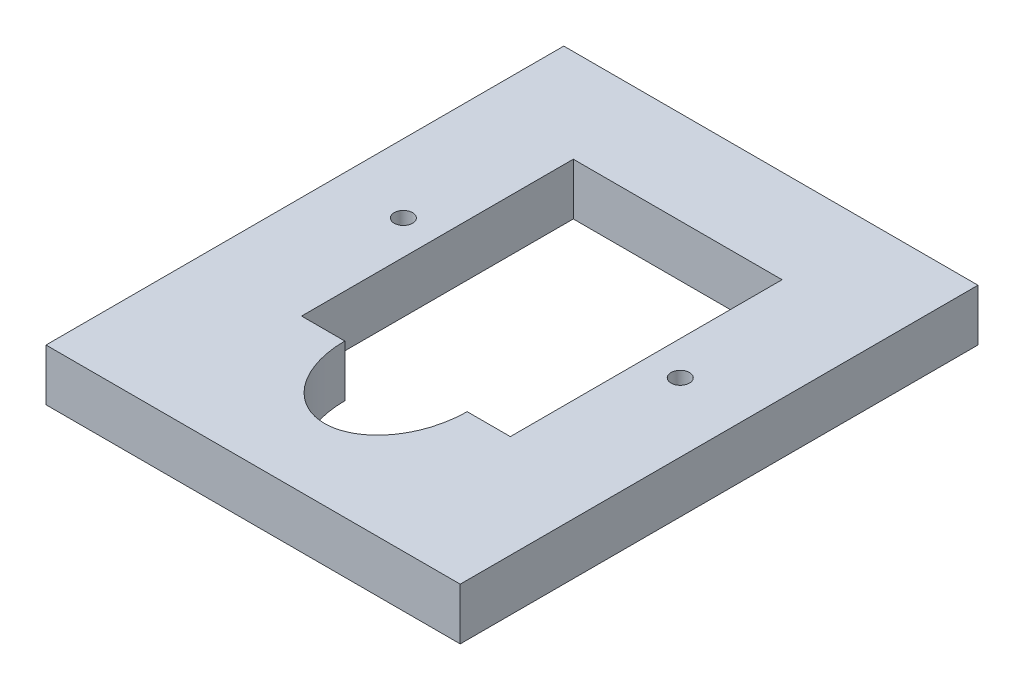
ISO-10303-21;
HEADER;
FILE_DESCRIPTION(('STEP AP214'),'2;1');
FILE_NAME('part.step','',(''),(''),'','','');
FILE_SCHEMA(('AUTOMOTIVE_DESIGN { 1 0 10303 214 1 1 1 1 }'));
ENDSEC;
DATA;
#1=APPLICATION_CONTEXT('core data for automotive mechanical design processes');
#2=APPLICATION_PROTOCOL_DEFINITION('international standard','automotive_design',2000,#1);
#3=PRODUCT_CONTEXT('',#1,'mechanical');
#4=PRODUCT('Part','Part','',(#3));
#5=PRODUCT_RELATED_PRODUCT_CATEGORY('part','',(#4));
#6=PRODUCT_DEFINITION_FORMATION('','',#4);
#7=PRODUCT_DEFINITION_CONTEXT('part definition',#1,'design');
#8=PRODUCT_DEFINITION('design','',#6,#7);
#9=PRODUCT_DEFINITION_SHAPE('','',#8);
#10=(LENGTH_UNIT() NAMED_UNIT(*) SI_UNIT(.MILLI.,.METRE.));
#11=(NAMED_UNIT(*) PLANE_ANGLE_UNIT() SI_UNIT($,.RADIAN.));
#12=(NAMED_UNIT(*) SI_UNIT($,.STERADIAN.) SOLID_ANGLE_UNIT());
#13=UNCERTAINTY_MEASURE_WITH_UNIT(LENGTH_MEASURE(1.E-05),#10,'distance_accuracy_value','');
#14=(GEOMETRIC_REPRESENTATION_CONTEXT(3) GLOBAL_UNCERTAINTY_ASSIGNED_CONTEXT((#13)) GLOBAL_UNIT_ASSIGNED_CONTEXT((#10,
#11,#12)) REPRESENTATION_CONTEXT('',''));
#15=CARTESIAN_POINT('',(0.,0.,0.));
#16=DIRECTION('',(0.,0.,1.));
#17=DIRECTION('',(1.,0.,0.));
#18=AXIS2_PLACEMENT_3D('',#15,#16,#17);
#19=CARTESIAN_POINT('',(0.,6.35,0.));
#20=DIRECTION('',(0.,1.,0.));
#21=DIRECTION('',(0.,0.,1.));
#22=AXIS2_PLACEMENT_3D('',#19,#20,#21);
#23=PLANE('',#22);
#24=CARTESIAN_POINT('',(38.7438981677544,6.35,-1.78835003718579));
#25=DIRECTION('',(0.,1.,0.));
#26=DIRECTION('',(0.,0.,1.));
#27=AXIS2_PLACEMENT_3D('',#24,#25,#26);
#28=CIRCLE('',#27,1.1303);
#29=CARTESIAN_POINT('',(38.7438981677544,6.35,-0.658050037185791));
#30=VERTEX_POINT('',#29);
#31=EDGE_CURVE('E233',#30,#30,#28,.T.);
#32=ORIENTED_EDGE('',*,*,#31,.F.);
#33=EDGE_LOOP('',(#32));
#34=FACE_BOUND('',#33,.T.);
#35=DIRECTION('',(0.,0.,1.));
#36=VECTOR('',#35,1.);
#37=CARTESIAN_POINT('',(-3.63346183224562,6.35,-29.8807500371858));
#38=LINE('',#37,#36);
#39=CARTESIAN_POINT('',(-3.63346183224562,6.35,-29.8807500371858));
#40=VERTEX_POINT('',#39);
#41=CARTESIAN_POINT('',(-3.63346183224562,6.35,33.6192499628142));
#42=VERTEX_POINT('',#41);
#43=EDGE_CURVE('E193',#40,#42,#38,.T.);
#44=ORIENTED_EDGE('',*,*,#43,.T.);
#45=DIRECTION('',(1.,0.,0.));
#46=VECTOR('',#45,1.);
#47=CARTESIAN_POINT('',(-3.63346183224562,6.35,33.6192499628142));
#48=LINE('',#47,#46);
#49=CARTESIAN_POINT('',(47.1665381677544,6.35,33.6192499628142));
#50=VERTEX_POINT('',#49);
#51=EDGE_CURVE('E207',#42,#50,#48,.T.);
#52=ORIENTED_EDGE('',*,*,#51,.T.);
#53=DIRECTION('',(0.,0.,-1.));
#54=VECTOR('',#53,1.);
#55=CARTESIAN_POINT('',(47.1665381677544,6.35,-29.8807500371858));
#56=LINE('',#55,#54);
#57=CARTESIAN_POINT('',(47.1665381677544,6.35,-29.8807500371858));
#58=VERTEX_POINT('',#57);
#59=EDGE_CURVE('E187',#50,#58,#56,.T.);
#60=ORIENTED_EDGE('',*,*,#59,.T.);
#61=DIRECTION('',(-1.,0.,0.));
#62=VECTOR('',#61,1.);
#63=CARTESIAN_POINT('',(-3.63346183224562,6.35,-29.8807500371858));
#64=LINE('',#63,#62);
#65=EDGE_CURVE('E200',#58,#40,#64,.T.);
#66=ORIENTED_EDGE('',*,*,#65,.T.);
#67=EDGE_LOOP('',(#44,#52,#60,#66));
#68=FACE_BOUND('',#67,.T.);
#69=DIRECTION('',(1.,0.,0.));
#70=VECTOR('',#69,1.);
#71=CARTESIAN_POINT('',(8.96493816775438,6.35,14.8740499628142));
#72=LINE('',#71,#70);
#73=CARTESIAN_POINT('',(8.96493816775438,6.35,14.8740499628142));
#74=VERTEX_POINT('',#73);
#75=CARTESIAN_POINT('',(14.2665381677544,6.35,14.8740499628142));
#76=VERTEX_POINT('',#75);
#77=EDGE_CURVE('E120',#74,#76,#72,.T.);
#78=ORIENTED_EDGE('',*,*,#77,.F.);
#79=DIRECTION('',(0.,0.,1.));
#80=VECTOR('',#79,1.);
#81=CARTESIAN_POINT('',(8.96493816775438,6.35,-18.4507500371858));
#82=LINE('',#81,#80);
#83=CARTESIAN_POINT('',(8.96493816775438,6.35,-18.4507500371858));
#84=VERTEX_POINT('',#83);
#85=EDGE_CURVE('E112',#84,#74,#82,.T.);
#86=ORIENTED_EDGE('',*,*,#85,.F.);
#87=DIRECTION('',(-1.,0.,0.));
#88=VECTOR('',#87,1.);
#89=CARTESIAN_POINT('',(8.96493816775438,6.35,-18.4507500371858));
#90=LINE('',#89,#88);
#91=CARTESIAN_POINT('',(34.5681381677544,6.35,-18.4507500371858));
#92=VERTEX_POINT('',#91);
#93=EDGE_CURVE('E219',#92,#84,#90,.T.);
#94=ORIENTED_EDGE('',*,*,#93,.F.);
#95=DIRECTION('',(0.,0.,-1.));
#96=VECTOR('',#95,1.);
#97=CARTESIAN_POINT('',(34.5681381677544,6.35,-18.4507500371858));
#98=LINE('',#97,#96);
#99=CARTESIAN_POINT('',(34.5681381677544,6.35,14.8740499628142));
#100=VERTEX_POINT('',#99);
#101=EDGE_CURVE('E234',#100,#92,#98,.T.);
#102=ORIENTED_EDGE('',*,*,#101,.F.);
#103=DIRECTION('',(1.,0.,0.));
#104=VECTOR('',#103,1.);
#105=CARTESIAN_POINT('',(29.2665381677544,6.35,14.8740499628142));
#106=LINE('',#105,#104);
#107=CARTESIAN_POINT('',(29.2665381677544,6.35,14.8740499628142));
#108=VERTEX_POINT('',#107);
#109=EDGE_CURVE('E136',#108,#100,#106,.T.);
#110=ORIENTED_EDGE('',*,*,#109,.F.);
#111=CARTESIAN_POINT('',(21.7665381677544,6.35,14.8740499628142));
#112=DIRECTION('',(0.,1.,0.));
#113=DIRECTION('',(0.,0.,-1.));
#114=AXIS2_PLACEMENT_3D('',#111,#112,#113);
#115=ELLIPSE('',#114,10.,7.5);
#116=EDGE_CURVE('E134',#76,#108,#115,.T.);
#117=ORIENTED_EDGE('',*,*,#116,.F.);
#118=EDGE_LOOP('',(#78,#86,#94,#102,#110,#117));
#119=FACE_BOUND('',#118,.T.);
#120=CARTESIAN_POINT('',(4.78917816775438,6.35,-1.78835003718579));
#121=DIRECTION('',(0.,1.,0.));
#122=DIRECTION('',(0.,0.,1.));
#123=AXIS2_PLACEMENT_3D('',#120,#121,#122);
#124=CIRCLE('',#123,1.1303);
#125=CARTESIAN_POINT('',(4.78917816775438,6.35,-0.658050037185794));
#126=VERTEX_POINT('',#125);
#127=EDGE_CURVE('E254',#126,#126,#124,.T.);
#128=ORIENTED_EDGE('',*,*,#127,.F.);
#129=EDGE_LOOP('',(#128));
#130=FACE_BOUND('',#129,.T.);
#131=ADVANCED_FACE('F35',(#34,#68,#119,#130),#23,.T.);
#132=CARTESIAN_POINT('',(0.,0.,0.));
#133=DIRECTION('',(0.,1.,0.));
#134=DIRECTION('',(0.,0.,1.));
#135=AXIS2_PLACEMENT_3D('',#132,#133,#134);
#136=PLANE('',#135);
#137=DIRECTION('',(0.,0.,1.));
#138=VECTOR('',#137,1.);
#139=CARTESIAN_POINT('',(-3.63346183224562,0.,-29.8807500371858));
#140=LINE('',#139,#138);
#141=CARTESIAN_POINT('',(-3.63346183224562,0.,-29.8807500371858));
#142=VERTEX_POINT('',#141);
#143=CARTESIAN_POINT('',(-3.63346183224562,0.,33.6192499628142));
#144=VERTEX_POINT('',#143);
#145=EDGE_CURVE('E128',#142,#144,#140,.T.);
#146=ORIENTED_EDGE('',*,*,#145,.F.);
#147=DIRECTION('',(-1.,0.,0.));
#148=VECTOR('',#147,1.);
#149=CARTESIAN_POINT('',(-3.63346183224562,0.,-29.8807500371858));
#150=LINE('',#149,#148);
#151=CARTESIAN_POINT('',(47.1665381677544,0.,-29.8807500371858));
#152=VERTEX_POINT('',#151);
#153=EDGE_CURVE('E191',#152,#142,#150,.T.);
#154=ORIENTED_EDGE('',*,*,#153,.F.);
#155=DIRECTION('',(0.,0.,-1.));
#156=VECTOR('',#155,1.);
#157=CARTESIAN_POINT('',(47.1665381677544,0.,-29.8807500371858));
#158=LINE('',#157,#156);
#159=CARTESIAN_POINT('',(47.1665381677544,0.,33.6192499628142));
#160=VERTEX_POINT('',#159);
#161=EDGE_CURVE('E183',#160,#152,#158,.T.);
#162=ORIENTED_EDGE('',*,*,#161,.F.);
#163=DIRECTION('',(1.,0.,0.));
#164=VECTOR('',#163,1.);
#165=CARTESIAN_POINT('',(-3.63346183224562,0.,33.6192499628142));
#166=LINE('',#165,#164);
#167=EDGE_CURVE('E176',#144,#160,#166,.T.);
#168=ORIENTED_EDGE('',*,*,#167,.F.);
#169=EDGE_LOOP('',(#146,#154,#162,#168));
#170=FACE_BOUND('',#169,.T.);
#171=DIRECTION('',(0.,0.,1.));
#172=VECTOR('',#171,1.);
#173=CARTESIAN_POINT('',(8.96493816775438,0.,-18.4507500371858));
#174=LINE('',#173,#172);
#175=CARTESIAN_POINT('',(8.96493816775438,0.,-18.4507500371858));
#176=VERTEX_POINT('',#175);
#177=CARTESIAN_POINT('',(8.96493816775438,0.,14.8740499628142));
#178=VERTEX_POINT('',#177);
#179=EDGE_CURVE('E58',#176,#178,#174,.T.);
#180=ORIENTED_EDGE('',*,*,#179,.T.);
#181=DIRECTION('',(1.,0.,0.));
#182=VECTOR('',#181,1.);
#183=CARTESIAN_POINT('',(8.96493816775438,0.,14.8740499628142));
#184=LINE('',#183,#182);
#185=CARTESIAN_POINT('',(14.2665381677544,0.,14.8740499628142));
#186=VERTEX_POINT('',#185);
#187=EDGE_CURVE('E127',#178,#186,#184,.T.);
#188=ORIENTED_EDGE('',*,*,#187,.T.);
#189=CARTESIAN_POINT('',(21.7665381677544,0.,14.8740499628142));
#190=DIRECTION('',(0.,1.,0.));
#191=DIRECTION('',(0.,0.,-1.));
#192=AXIS2_PLACEMENT_3D('',#189,#190,#191);
#193=ELLIPSE('',#192,10.,7.5);
#194=CARTESIAN_POINT('',(29.2665381677544,0.,14.8740499628142));
#195=VERTEX_POINT('',#194);
#196=EDGE_CURVE('E228',#186,#195,#193,.T.);
#197=ORIENTED_EDGE('',*,*,#196,.T.);
#198=DIRECTION('',(1.,0.,0.));
#199=VECTOR('',#198,1.);
#200=CARTESIAN_POINT('',(29.2665381677544,0.,14.8740499628142));
#201=LINE('',#200,#199);
#202=CARTESIAN_POINT('',(34.5681381677544,0.,14.8740499628142));
#203=VERTEX_POINT('',#202);
#204=EDGE_CURVE('E225',#195,#203,#201,.T.);
#205=ORIENTED_EDGE('',*,*,#204,.T.);
#206=DIRECTION('',(0.,0.,-1.));
#207=VECTOR('',#206,1.);
#208=CARTESIAN_POINT('',(34.5681381677544,0.,-18.4507500371858));
#209=LINE('',#208,#207);
#210=CARTESIAN_POINT('',(34.5681381677544,0.,-18.4507500371858));
#211=VERTEX_POINT('',#210);
#212=EDGE_CURVE('E222',#203,#211,#209,.T.);
#213=ORIENTED_EDGE('',*,*,#212,.T.);
#214=DIRECTION('',(-1.,0.,0.));
#215=VECTOR('',#214,1.);
#216=CARTESIAN_POINT('',(8.96493816775438,0.,-18.4507500371858));
#217=LINE('',#216,#215);
#218=EDGE_CURVE('E121',#211,#176,#217,.T.);
#219=ORIENTED_EDGE('',*,*,#218,.T.);
#220=EDGE_LOOP('',(#180,#188,#197,#205,#213,#219));
#221=FACE_BOUND('',#220,.T.);
#222=CARTESIAN_POINT('',(38.7438981677544,0.,-1.78835003718579));
#223=DIRECTION('',(0.,1.,0.));
#224=DIRECTION('',(0.,0.,1.));
#225=AXIS2_PLACEMENT_3D('',#222,#223,#224);
#226=CIRCLE('',#225,1.1303);
#227=CARTESIAN_POINT('',(38.7438981677544,0.,-0.658050037185791));
#228=VERTEX_POINT('',#227);
#229=EDGE_CURVE('E249',#228,#228,#226,.T.);
#230=ORIENTED_EDGE('',*,*,#229,.T.);
#231=EDGE_LOOP('',(#230));
#232=FACE_BOUND('',#231,.T.);
#233=CARTESIAN_POINT('',(4.78917816775438,0.,-1.78835003718579));
#234=DIRECTION('',(0.,1.,0.));
#235=DIRECTION('',(0.,0.,1.));
#236=AXIS2_PLACEMENT_3D('',#233,#234,#235);
#237=CIRCLE('',#236,1.1303);
#238=CARTESIAN_POINT('',(4.78917816775438,0.,-0.658050037185794));
#239=VERTEX_POINT('',#238);
#240=EDGE_CURVE('E252',#239,#239,#237,.T.);
#241=ORIENTED_EDGE('',*,*,#240,.T.);
#242=EDGE_LOOP('',(#241));
#243=FACE_BOUND('',#242,.T.);
#244=ADVANCED_FACE('F157',(#170,#221,#232,#243),#136,.F.);
#245=CARTESIAN_POINT('',(-3.63346183224562,6.35,-29.8807500371858));
#246=DIRECTION('',(1.,0.,0.));
#247=DIRECTION('',(0.,0.,-1.));
#248=AXIS2_PLACEMENT_3D('',#245,#246,#247);
#249=PLANE('',#248);
#250=ORIENTED_EDGE('',*,*,#145,.T.);
#251=DIRECTION('',(0.,-1.,0.));
#252=VECTOR('',#251,1.);
#253=CARTESIAN_POINT('',(-3.63346183224562,6.35,33.6192499628142));
#254=LINE('',#253,#252);
#255=EDGE_CURVE('E11',#42,#144,#254,.T.);
#256=ORIENTED_EDGE('',*,*,#255,.F.);
#257=ORIENTED_EDGE('',*,*,#43,.F.);
#258=DIRECTION('',(0.,-1.,0.));
#259=VECTOR('',#258,1.);
#260=CARTESIAN_POINT('',(-3.63346183224562,6.35,-29.8807500371858));
#261=LINE('',#260,#259);
#262=EDGE_CURVE('E197',#40,#142,#261,.T.);
#263=ORIENTED_EDGE('',*,*,#262,.T.);
#264=EDGE_LOOP('',(#250,#256,#257,#263));
#265=FACE_BOUND('',#264,.T.);
#266=ADVANCED_FACE('F37',(#265),#249,.F.);
#267=CARTESIAN_POINT('',(-3.63346183224562,6.35,33.6192499628142));
#268=DIRECTION('',(0.,0.,-1.));
#269=DIRECTION('',(-1.,0.,0.));
#270=AXIS2_PLACEMENT_3D('',#267,#268,#269);
#271=PLANE('',#270);
#272=ORIENTED_EDGE('',*,*,#167,.T.);
#273=DIRECTION('',(0.,-1.,0.));
#274=VECTOR('',#273,1.);
#275=CARTESIAN_POINT('',(47.1665381677544,6.35,33.6192499628142));
#276=LINE('',#275,#274);
#277=EDGE_CURVE('E43',#50,#160,#276,.T.);
#278=ORIENTED_EDGE('',*,*,#277,.F.);
#279=ORIENTED_EDGE('',*,*,#51,.F.);
#280=ORIENTED_EDGE('',*,*,#255,.T.);
#281=EDGE_LOOP('',(#272,#278,#279,#280));
#282=FACE_BOUND('',#281,.T.);
#283=ADVANCED_FACE('F167',(#282),#271,.F.);
#284=CARTESIAN_POINT('',(47.1665381677544,6.35,-29.8807500371858));
#285=DIRECTION('',(-1.,0.,0.));
#286=DIRECTION('',(0.,0.,1.));
#287=AXIS2_PLACEMENT_3D('',#284,#285,#286);
#288=PLANE('',#287);
#289=ORIENTED_EDGE('',*,*,#161,.T.);
#290=DIRECTION('',(0.,-1.,0.));
#291=VECTOR('',#290,1.);
#292=CARTESIAN_POINT('',(47.1665381677544,6.35,-29.8807500371858));
#293=LINE('',#292,#291);
#294=EDGE_CURVE('E188',#58,#152,#293,.T.);
#295=ORIENTED_EDGE('',*,*,#294,.F.);
#296=ORIENTED_EDGE('',*,*,#59,.F.);
#297=ORIENTED_EDGE('',*,*,#277,.T.);
#298=EDGE_LOOP('',(#289,#295,#296,#297));
#299=FACE_BOUND('',#298,.T.);
#300=ADVANCED_FACE('F164',(#299),#288,.F.);
#301=CARTESIAN_POINT('',(-3.63346183224562,6.35,-29.8807500371858));
#302=DIRECTION('',(0.,0.,1.));
#303=DIRECTION('',(1.,0.,0.));
#304=AXIS2_PLACEMENT_3D('',#301,#302,#303);
#305=PLANE('',#304);
#306=ORIENTED_EDGE('',*,*,#153,.T.);
#307=ORIENTED_EDGE('',*,*,#262,.F.);
#308=ORIENTED_EDGE('',*,*,#65,.F.);
#309=ORIENTED_EDGE('',*,*,#294,.T.);
#310=EDGE_LOOP('',(#306,#307,#308,#309));
#311=FACE_BOUND('',#310,.T.);
#312=ADVANCED_FACE('F154',(#311),#305,.F.);
#313=CARTESIAN_POINT('',(8.96493816775438,6.35,-18.4507500371858));
#314=DIRECTION('',(1.,0.,0.));
#315=DIRECTION('',(0.,0.,-1.));
#316=AXIS2_PLACEMENT_3D('',#313,#314,#315);
#317=PLANE('',#316);
#318=ORIENTED_EDGE('',*,*,#179,.F.);
#319=DIRECTION('',(0.,-1.,0.));
#320=VECTOR('',#319,1.);
#321=CARTESIAN_POINT('',(8.96493816775438,6.35,-18.4507500371858));
#322=LINE('',#321,#320);
#323=EDGE_CURVE('E116',#84,#176,#322,.T.);
#324=ORIENTED_EDGE('',*,*,#323,.F.);
#325=ORIENTED_EDGE('',*,*,#85,.T.);
#326=DIRECTION('',(0.,-1.,0.));
#327=VECTOR('',#326,1.);
#328=CARTESIAN_POINT('',(8.96493816775438,6.35,14.8740499628142));
#329=LINE('',#328,#327);
#330=EDGE_CURVE('E115',#74,#178,#329,.T.);
#331=ORIENTED_EDGE('',*,*,#330,.T.);
#332=EDGE_LOOP('',(#318,#324,#325,#331));
#333=FACE_BOUND('',#332,.T.);
#334=ADVANCED_FACE('F114',(#333),#317,.T.);
#335=CARTESIAN_POINT('',(8.96493816775438,6.35,14.8740499628142));
#336=DIRECTION('',(0.,0.,-1.));
#337=DIRECTION('',(-1.,0.,0.));
#338=AXIS2_PLACEMENT_3D('',#335,#336,#337);
#339=PLANE('',#338);
#340=ORIENTED_EDGE('',*,*,#187,.F.);
#341=ORIENTED_EDGE('',*,*,#330,.F.);
#342=ORIENTED_EDGE('',*,*,#77,.T.);
#343=DIRECTION('',(0.,-1.,0.));
#344=VECTOR('',#343,1.);
#345=CARTESIAN_POINT('',(14.2665381677544,6.35,14.8740499628142));
#346=LINE('',#345,#344);
#347=EDGE_CURVE('E129',#76,#186,#346,.T.);
#348=ORIENTED_EDGE('',*,*,#347,.T.);
#349=EDGE_LOOP('',(#340,#341,#342,#348));
#350=FACE_BOUND('',#349,.T.);
#351=ADVANCED_FACE('F124',(#350),#339,.T.);
#352=DIRECTION('',(0.,-1.,0.));
#353=VECTOR('',#352,1.);
#354=SURFACE_OF_LINEAR_EXTRUSION('',#115,#353);
#355=ORIENTED_EDGE('',*,*,#196,.F.);
#356=ORIENTED_EDGE('',*,*,#347,.F.);
#357=ORIENTED_EDGE('',*,*,#116,.T.);
#358=DIRECTION('',(0.,-1.,0.));
#359=VECTOR('',#358,1.);
#360=CARTESIAN_POINT('',(29.2665381677544,6.35,14.8740499628142));
#361=LINE('',#360,#359);
#362=EDGE_CURVE('E213',#108,#195,#361,.T.);
#363=ORIENTED_EDGE('',*,*,#362,.T.);
#364=EDGE_LOOP('',(#355,#356,#357,#363));
#365=FACE_BOUND('',#364,.T.);
#366=ADVANCED_FACE('F143',(#365),#354,.T.);
#367=CARTESIAN_POINT('',(29.2665381677544,6.35,14.8740499628142));
#368=DIRECTION('',(0.,0.,-1.));
#369=DIRECTION('',(-1.,0.,0.));
#370=AXIS2_PLACEMENT_3D('',#367,#368,#369);
#371=PLANE('',#370);
#372=ORIENTED_EDGE('',*,*,#204,.F.);
#373=ORIENTED_EDGE('',*,*,#362,.F.);
#374=ORIENTED_EDGE('',*,*,#109,.T.);
#375=DIRECTION('',(0.,-1.,0.));
#376=VECTOR('',#375,1.);
#377=CARTESIAN_POINT('',(34.5681381677544,6.35,14.8740499628142));
#378=LINE('',#377,#376);
#379=EDGE_CURVE('E215',#100,#203,#378,.T.);
#380=ORIENTED_EDGE('',*,*,#379,.T.);
#381=EDGE_LOOP('',(#372,#373,#374,#380));
#382=FACE_BOUND('',#381,.T.);
#383=ADVANCED_FACE('F147',(#382),#371,.T.);
#384=CARTESIAN_POINT('',(34.5681381677544,6.35,-18.4507500371858));
#385=DIRECTION('',(-1.,0.,0.));
#386=DIRECTION('',(0.,0.,1.));
#387=AXIS2_PLACEMENT_3D('',#384,#385,#386);
#388=PLANE('',#387);
#389=ORIENTED_EDGE('',*,*,#212,.F.);
#390=ORIENTED_EDGE('',*,*,#379,.F.);
#391=ORIENTED_EDGE('',*,*,#101,.T.);
#392=DIRECTION('',(0.,-1.,0.));
#393=VECTOR('',#392,1.);
#394=CARTESIAN_POINT('',(34.5681381677544,6.35,-18.4507500371858));
#395=LINE('',#394,#393);
#396=EDGE_CURVE('E50',#92,#211,#395,.T.);
#397=ORIENTED_EDGE('',*,*,#396,.T.);
#398=EDGE_LOOP('',(#389,#390,#391,#397));
#399=FACE_BOUND('',#398,.T.);
#400=ADVANCED_FACE('F242',(#399),#388,.T.);
#401=CARTESIAN_POINT('',(8.96493816775438,6.35,-18.4507500371858));
#402=DIRECTION('',(0.,0.,1.));
#403=DIRECTION('',(1.,0.,0.));
#404=AXIS2_PLACEMENT_3D('',#401,#402,#403);
#405=PLANE('',#404);
#406=ORIENTED_EDGE('',*,*,#218,.F.);
#407=ORIENTED_EDGE('',*,*,#396,.F.);
#408=ORIENTED_EDGE('',*,*,#93,.T.);
#409=ORIENTED_EDGE('',*,*,#323,.T.);
#410=EDGE_LOOP('',(#406,#407,#408,#409));
#411=FACE_BOUND('',#410,.T.);
#412=ADVANCED_FACE('F243',(#411),#405,.T.);
#413=CARTESIAN_POINT('',(38.7438981677544,6.35,-1.78835003718579));
#414=DIRECTION('',(0.,-1.,0.));
#415=DIRECTION('',(0.,0.,-1.));
#416=AXIS2_PLACEMENT_3D('',#413,#414,#415);
#417=CYLINDRICAL_SURFACE('',#416,1.1303);
#418=ORIENTED_EDGE('',*,*,#31,.T.);
#419=EDGE_LOOP('',(#418));
#420=FACE_BOUND('',#419,.T.);
#421=ORIENTED_EDGE('',*,*,#229,.F.);
#422=EDGE_LOOP('',(#421));
#423=FACE_BOUND('',#422,.T.);
#424=ADVANCED_FACE('F262',(#420,#423),#417,.F.);
#425=CARTESIAN_POINT('',(4.78917816775438,6.35,-1.78835003718579));
#426=DIRECTION('',(0.,-1.,0.));
#427=DIRECTION('',(0.,0.,-1.));
#428=AXIS2_PLACEMENT_3D('',#425,#426,#427);
#429=CYLINDRICAL_SURFACE('',#428,1.1303);
#430=ORIENTED_EDGE('',*,*,#127,.T.);
#431=EDGE_LOOP('',(#430));
#432=FACE_BOUND('',#431,.T.);
#433=ORIENTED_EDGE('',*,*,#240,.F.);
#434=EDGE_LOOP('',(#433));
#435=FACE_BOUND('',#434,.T.);
#436=ADVANCED_FACE('F265',(#432,#435),#429,.F.);
#437=CLOSED_SHELL('',(#131,#244,#266,#283,#300,#312,#334,#351,#366,#383,#400,#412,#424,#436));
#438=MANIFOLD_SOLID_BREP('B2',#437);
#439=ADVANCED_BREP_SHAPE_REPRESENTATION('',(#18,#438),#14);
#440=SHAPE_DEFINITION_REPRESENTATION(#9,#439);
ENDSEC;
END-ISO-10303-21;
